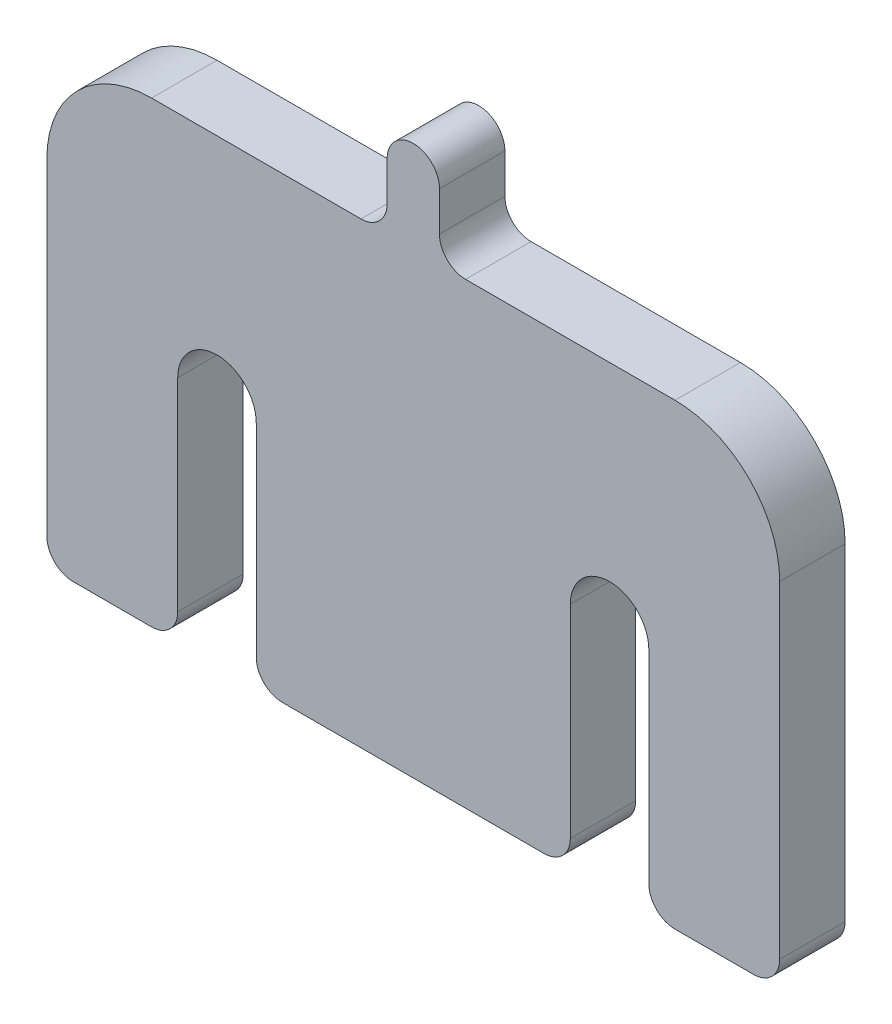
ISO-10303-21;
HEADER;
FILE_DESCRIPTION(('STEP AP214'),'2;1');
FILE_NAME('part.step','',(''),(''),'','','');
FILE_SCHEMA(('AUTOMOTIVE_DESIGN { 1 0 10303 214 1 1 1 1 }'));
ENDSEC;
DATA;
#1=APPLICATION_CONTEXT('core data for automotive mechanical design processes');
#2=APPLICATION_PROTOCOL_DEFINITION('international standard','automotive_design',2000,#1);
#3=PRODUCT_CONTEXT('',#1,'mechanical');
#4=PRODUCT('Part','Part','',(#3));
#5=PRODUCT_RELATED_PRODUCT_CATEGORY('part','',(#4));
#6=PRODUCT_DEFINITION_FORMATION('','',#4);
#7=PRODUCT_DEFINITION_CONTEXT('part definition',#1,'design');
#8=PRODUCT_DEFINITION('design','',#6,#7);
#9=PRODUCT_DEFINITION_SHAPE('','',#8);
#10=(LENGTH_UNIT() NAMED_UNIT(*) SI_UNIT(.MILLI.,.METRE.));
#11=(NAMED_UNIT(*) PLANE_ANGLE_UNIT() SI_UNIT($,.RADIAN.));
#12=(NAMED_UNIT(*) SI_UNIT($,.STERADIAN.) SOLID_ANGLE_UNIT());
#13=UNCERTAINTY_MEASURE_WITH_UNIT(LENGTH_MEASURE(1.E-05),#10,'distance_accuracy_value','');
#14=(GEOMETRIC_REPRESENTATION_CONTEXT(3) GLOBAL_UNCERTAINTY_ASSIGNED_CONTEXT((#13)) GLOBAL_UNIT_ASSIGNED_CONTEXT((#10,
#11,#12)) REPRESENTATION_CONTEXT('',''));
#15=CARTESIAN_POINT('',(0.,0.,0.));
#16=DIRECTION('',(0.,0.,1.));
#17=DIRECTION('',(1.,0.,0.));
#18=AXIS2_PLACEMENT_3D('',#15,#16,#17);
#19=CARTESIAN_POINT('',(15.,0.,-5.));
#20=DIRECTION('',(0.,0.,1.));
#21=DIRECTION('',(-1.,0.,0.));
#22=AXIS2_PLACEMENT_3D('',#19,#20,#21);
#23=CYLINDRICAL_SURFACE('',#22,3.);
#24=CARTESIAN_POINT('',(15.,0.,0.));
#25=DIRECTION('',(0.,0.,1.));
#26=DIRECTION('',(1.,0.,0.));
#27=AXIS2_PLACEMENT_3D('',#24,#25,#26);
#28=CIRCLE('',#27,3.);
#29=CARTESIAN_POINT('',(18.,0.,0.));
#30=VERTEX_POINT('',#29);
#31=CARTESIAN_POINT('',(12.,0.,0.));
#32=VERTEX_POINT('',#31);
#33=EDGE_CURVE('E277',#30,#32,#28,.T.);
#34=ORIENTED_EDGE('',*,*,#33,.T.);
#35=DIRECTION('',(0.,0.,1.));
#36=VECTOR('',#35,1.);
#37=CARTESIAN_POINT('',(12.,0.,-5.));
#38=LINE('',#37,#36);
#39=CARTESIAN_POINT('',(12.,0.,-5.));
#40=VERTEX_POINT('',#39);
#41=EDGE_CURVE('E237',#40,#32,#38,.T.);
#42=ORIENTED_EDGE('',*,*,#41,.F.);
#43=CARTESIAN_POINT('',(15.,0.,-5.));
#44=DIRECTION('',(0.,0.,1.));
#45=DIRECTION('',(1.,0.,0.));
#46=AXIS2_PLACEMENT_3D('',#43,#44,#45);
#47=CIRCLE('',#46,3.);
#48=CARTESIAN_POINT('',(18.,0.,-5.));
#49=VERTEX_POINT('',#48);
#50=EDGE_CURVE('E216',#49,#40,#47,.T.);
#51=ORIENTED_EDGE('',*,*,#50,.F.);
#52=DIRECTION('',(0.,0.,1.));
#53=VECTOR('',#52,1.);
#54=CARTESIAN_POINT('',(18.,0.,-5.));
#55=LINE('',#54,#53);
#56=EDGE_CURVE('E226',#49,#30,#55,.T.);
#57=ORIENTED_EDGE('',*,*,#56,.T.);
#58=EDGE_LOOP('',(#34,#42,#51,#57));
#59=FACE_BOUND('',#58,.T.);
#60=ADVANCED_FACE('F39',(#59),#23,.F.);
#61=CARTESIAN_POINT('',(18.,0.,-5.));
#62=DIRECTION('',(1.,0.,0.));
#63=DIRECTION('',(0.,1.,0.));
#64=AXIS2_PLACEMENT_3D('',#61,#62,#63);
#65=PLANE('',#64);
#66=DIRECTION('',(0.,-1.,0.));
#67=VECTOR('',#66,1.);
#68=CARTESIAN_POINT('',(18.,0.,0.));
#69=LINE('',#68,#67);
#70=CARTESIAN_POINT('',(18.,-15.5,0.));
#71=VERTEX_POINT('',#70);
#72=EDGE_CURVE('E229',#30,#71,#69,.T.);
#73=ORIENTED_EDGE('',*,*,#72,.F.);
#74=ORIENTED_EDGE('',*,*,#56,.F.);
#75=DIRECTION('',(0.,-1.,0.));
#76=VECTOR('',#75,1.);
#77=CARTESIAN_POINT('',(18.,0.,-5.));
#78=LINE('',#77,#76);
#79=CARTESIAN_POINT('',(18.,-15.5,-5.));
#80=VERTEX_POINT('',#79);
#81=EDGE_CURVE('E210',#49,#80,#78,.T.);
#82=ORIENTED_EDGE('',*,*,#81,.T.);
#83=DIRECTION('',(0.,0.,1.));
#84=VECTOR('',#83,1.);
#85=CARTESIAN_POINT('',(18.,-15.5,-5.));
#86=LINE('',#85,#84);
#87=EDGE_CURVE('E384',#71,#80,#86,.F.);
#88=ORIENTED_EDGE('',*,*,#87,.F.);
#89=EDGE_LOOP('',(#73,#74,#82,#88));
#90=FACE_BOUND('',#89,.T.);
#91=ADVANCED_FACE('F227',(#90),#65,.F.);
#92=CARTESIAN_POINT('',(0.,-17.5,-5.));
#93=DIRECTION('',(0.,-1.,0.));
#94=DIRECTION('',(1.,0.,0.));
#95=AXIS2_PLACEMENT_3D('',#92,#93,#94);
#96=PLANE('',#95);
#97=DIRECTION('',(-1.,0.,0.));
#98=VECTOR('',#97,1.);
#99=CARTESIAN_POINT('',(0.,-17.5,-5.));
#100=LINE('',#99,#98);
#101=CARTESIAN_POINT('',(26.,-17.5,-5.));
#102=VERTEX_POINT('',#101);
#103=CARTESIAN_POINT('',(20.,-17.5,-5.));
#104=VERTEX_POINT('',#103);
#105=EDGE_CURVE('E223',#102,#104,#100,.T.);
#106=ORIENTED_EDGE('',*,*,#105,.F.);
#107=DIRECTION('',(0.,0.,1.));
#108=VECTOR('',#107,1.);
#109=CARTESIAN_POINT('',(26.,-17.5,-5.));
#110=LINE('',#109,#108);
#111=CARTESIAN_POINT('',(26.,-17.5,0.));
#112=VERTEX_POINT('',#111);
#113=EDGE_CURVE('E378',#112,#102,#110,.F.);
#114=ORIENTED_EDGE('',*,*,#113,.F.);
#115=DIRECTION('',(-1.,0.,0.));
#116=VECTOR('',#115,1.);
#117=CARTESIAN_POINT('',(0.,-17.5,0.));
#118=LINE('',#117,#116);
#119=CARTESIAN_POINT('',(20.,-17.5,0.));
#120=VERTEX_POINT('',#119);
#121=EDGE_CURVE('E280',#112,#120,#118,.T.);
#122=ORIENTED_EDGE('',*,*,#121,.T.);
#123=DIRECTION('',(0.,0.,1.));
#124=VECTOR('',#123,1.);
#125=CARTESIAN_POINT('',(20.,-17.5,0.));
#126=LINE('',#125,#124);
#127=EDGE_CURVE('E381',#104,#120,#126,.T.);
#128=ORIENTED_EDGE('',*,*,#127,.F.);
#129=EDGE_LOOP('',(#106,#114,#122,#128));
#130=FACE_BOUND('',#129,.T.);
#131=ADVANCED_FACE('F432',(#130),#96,.T.);
#132=CARTESIAN_POINT('',(28.,0.,-5.));
#133=DIRECTION('',(-1.,0.,0.));
#134=DIRECTION('',(0.,0.,-1.));
#135=AXIS2_PLACEMENT_3D('',#132,#133,#134);
#136=PLANE('',#135);
#137=DIRECTION('',(0.,1.,0.));
#138=VECTOR('',#137,1.);
#139=CARTESIAN_POINT('',(28.,0.,0.));
#140=LINE('',#139,#138);
#141=CARTESIAN_POINT('',(28.,-15.5,0.));
#142=VERTEX_POINT('',#141);
#143=CARTESIAN_POINT('',(28.,9.5,0.));
#144=VERTEX_POINT('',#143);
#145=EDGE_CURVE('E283',#142,#144,#140,.T.);
#146=ORIENTED_EDGE('',*,*,#145,.F.);
#147=DIRECTION('',(0.,0.,1.));
#148=VECTOR('',#147,1.);
#149=CARTESIAN_POINT('',(28.,-15.5,0.));
#150=LINE('',#149,#148);
#151=CARTESIAN_POINT('',(28.,-15.5,-5.));
#152=VERTEX_POINT('',#151);
#153=EDGE_CURVE('E389',#152,#142,#150,.T.);
#154=ORIENTED_EDGE('',*,*,#153,.F.);
#155=DIRECTION('',(0.,1.,0.));
#156=VECTOR('',#155,1.);
#157=CARTESIAN_POINT('',(28.,0.,-5.));
#158=LINE('',#157,#156);
#159=CARTESIAN_POINT('',(28.,9.5,-5.));
#160=VERTEX_POINT('',#159);
#161=EDGE_CURVE('E250',#152,#160,#158,.T.);
#162=ORIENTED_EDGE('',*,*,#161,.T.);
#163=DIRECTION('',(0.,0.,1.));
#164=VECTOR('',#163,1.);
#165=CARTESIAN_POINT('',(28.,9.5,-5.));
#166=LINE('',#165,#164);
#167=EDGE_CURVE('E11',#144,#160,#166,.F.);
#168=ORIENTED_EDGE('',*,*,#167,.F.);
#169=EDGE_LOOP('',(#146,#154,#162,#168));
#170=FACE_BOUND('',#169,.T.);
#171=ADVANCED_FACE('F425',(#170),#136,.F.);
#172=CARTESIAN_POINT('',(0.,17.5,-5.));
#173=DIRECTION('',(0.,-1.,0.));
#174=DIRECTION('',(1.,0.,0.));
#175=AXIS2_PLACEMENT_3D('',#172,#173,#174);
#176=PLANE('',#175);
#177=DIRECTION('',(-1.,0.,0.));
#178=VECTOR('',#177,1.);
#179=CARTESIAN_POINT('',(0.,17.5,-5.));
#180=LINE('',#179,#178);
#181=CARTESIAN_POINT('',(20.,17.5,-5.));
#182=VERTEX_POINT('',#181);
#183=CARTESIAN_POINT('',(4.,17.5,-5.));
#184=VERTEX_POINT('',#183);
#185=EDGE_CURVE('E253',#182,#184,#180,.T.);
#186=ORIENTED_EDGE('',*,*,#185,.T.);
#187=DIRECTION('',(0.,0.,1.));
#188=VECTOR('',#187,1.);
#189=CARTESIAN_POINT('',(4.,17.5,-5.));
#190=LINE('',#189,#188);
#191=CARTESIAN_POINT('',(4.,17.5,0.));
#192=VERTEX_POINT('',#191);
#193=EDGE_CURVE('E331',#192,#184,#190,.F.);
#194=ORIENTED_EDGE('',*,*,#193,.F.);
#195=DIRECTION('',(-1.,0.,0.));
#196=VECTOR('',#195,1.);
#197=CARTESIAN_POINT('',(0.,17.5,0.));
#198=LINE('',#197,#196);
#199=CARTESIAN_POINT('',(20.,17.5,0.));
#200=VERTEX_POINT('',#199);
#201=EDGE_CURVE('E287',#200,#192,#198,.T.);
#202=ORIENTED_EDGE('',*,*,#201,.F.);
#203=DIRECTION('',(0.,0.,1.));
#204=VECTOR('',#203,1.);
#205=CARTESIAN_POINT('',(20.,17.5,-5.));
#206=LINE('',#205,#204);
#207=EDGE_CURVE('E47',#182,#200,#206,.T.);
#208=ORIENTED_EDGE('',*,*,#207,.F.);
#209=EDGE_LOOP('',(#186,#194,#202,#208));
#210=FACE_BOUND('',#209,.T.);
#211=ADVANCED_FACE('F416',(#210),#176,.F.);
#212=CARTESIAN_POINT('',(2.,0.,-5.));
#213=DIRECTION('',(1.,0.,0.));
#214=DIRECTION('',(0.,1.,0.));
#215=AXIS2_PLACEMENT_3D('',#212,#213,#214);
#216=PLANE('',#215);
#217=DIRECTION('',(0.,-1.,0.));
#218=VECTOR('',#217,1.);
#219=CARTESIAN_POINT('',(2.,0.,-5.));
#220=LINE('',#219,#218);
#221=CARTESIAN_POINT('',(2.,22.5,-5.));
#222=VERTEX_POINT('',#221);
#223=CARTESIAN_POINT('',(2.,19.5,-5.));
#224=VERTEX_POINT('',#223);
#225=EDGE_CURVE('E256',#222,#224,#220,.T.);
#226=ORIENTED_EDGE('',*,*,#225,.F.);
#227=DIRECTION('',(0.,0.,1.));
#228=VECTOR('',#227,1.);
#229=CARTESIAN_POINT('',(2.,22.5,-5.));
#230=LINE('',#229,#228);
#231=CARTESIAN_POINT('',(2.,22.5,0.));
#232=VERTEX_POINT('',#231);
#233=EDGE_CURVE('E234',#222,#232,#230,.T.);
#234=ORIENTED_EDGE('',*,*,#233,.T.);
#235=DIRECTION('',(0.,-1.,0.));
#236=VECTOR('',#235,1.);
#237=CARTESIAN_POINT('',(2.,0.,0.));
#238=LINE('',#237,#236);
#239=CARTESIAN_POINT('',(2.,19.5,0.));
#240=VERTEX_POINT('',#239);
#241=EDGE_CURVE('E290',#232,#240,#238,.T.);
#242=ORIENTED_EDGE('',*,*,#241,.T.);
#243=DIRECTION('',(0.,0.,1.));
#244=VECTOR('',#243,1.);
#245=CARTESIAN_POINT('',(2.,19.5,-5.));
#246=LINE('',#245,#244);
#247=EDGE_CURVE('E328',#224,#240,#246,.T.);
#248=ORIENTED_EDGE('',*,*,#247,.F.);
#249=EDGE_LOOP('',(#226,#234,#242,#248));
#250=FACE_BOUND('',#249,.T.);
#251=ADVANCED_FACE('F469',(#250),#216,.T.);
#252=CARTESIAN_POINT('',(0.,22.5,-5.));
#253=DIRECTION('',(0.,0.,1.));
#254=DIRECTION('',(-1.,0.,0.));
#255=AXIS2_PLACEMENT_3D('',#252,#253,#254);
#256=CYLINDRICAL_SURFACE('',#255,2.);
#257=CARTESIAN_POINT('',(0.,22.5,0.));
#258=DIRECTION('',(0.,0.,1.));
#259=DIRECTION('',(1.,0.,0.));
#260=AXIS2_PLACEMENT_3D('',#257,#258,#259);
#261=CIRCLE('',#260,2.);
#262=CARTESIAN_POINT('',(-2.,22.5,0.));
#263=VERTEX_POINT('',#262);
#264=EDGE_CURVE('E294',#232,#263,#261,.T.);
#265=ORIENTED_EDGE('',*,*,#264,.F.);
#266=ORIENTED_EDGE('',*,*,#233,.F.);
#267=CARTESIAN_POINT('',(0.,22.5,-5.));
#268=DIRECTION('',(0.,0.,1.));
#269=DIRECTION('',(1.,0.,0.));
#270=AXIS2_PLACEMENT_3D('',#267,#268,#269);
#271=CIRCLE('',#270,2.);
#272=CARTESIAN_POINT('',(-2.,22.5,-5.));
#273=VERTEX_POINT('',#272);
#274=EDGE_CURVE('E260',#222,#273,#271,.T.);
#275=ORIENTED_EDGE('',*,*,#274,.T.);
#276=DIRECTION('',(0.,0.,1.));
#277=VECTOR('',#276,1.);
#278=CARTESIAN_POINT('',(-2.,22.5,-5.));
#279=LINE('',#278,#277);
#280=EDGE_CURVE('E318',#273,#263,#279,.T.);
#281=ORIENTED_EDGE('',*,*,#280,.T.);
#282=EDGE_LOOP('',(#265,#266,#275,#281));
#283=FACE_BOUND('',#282,.T.);
#284=ADVANCED_FACE('F465',(#283),#256,.T.);
#285=CARTESIAN_POINT('',(-2.,0.,-5.));
#286=DIRECTION('',(1.,0.,0.));
#287=DIRECTION('',(0.,1.,0.));
#288=AXIS2_PLACEMENT_3D('',#285,#286,#287);
#289=PLANE('',#288);
#290=DIRECTION('',(0.,-1.,0.));
#291=VECTOR('',#290,1.);
#292=CARTESIAN_POINT('',(-2.,0.,0.));
#293=LINE('',#292,#291);
#294=CARTESIAN_POINT('',(-2.,19.5,0.));
#295=VERTEX_POINT('',#294);
#296=EDGE_CURVE('E297',#263,#295,#293,.T.);
#297=ORIENTED_EDGE('',*,*,#296,.F.);
#298=ORIENTED_EDGE('',*,*,#280,.F.);
#299=DIRECTION('',(0.,-1.,0.));
#300=VECTOR('',#299,1.);
#301=CARTESIAN_POINT('',(-2.,0.,-5.));
#302=LINE('',#301,#300);
#303=CARTESIAN_POINT('',(-2.,19.5,-5.));
#304=VERTEX_POINT('',#303);
#305=EDGE_CURVE('E263',#273,#304,#302,.T.);
#306=ORIENTED_EDGE('',*,*,#305,.T.);
#307=DIRECTION('',(0.,0.,1.));
#308=VECTOR('',#307,1.);
#309=CARTESIAN_POINT('',(-2.,19.5,-5.));
#310=LINE('',#309,#308);
#311=EDGE_CURVE('E325',#295,#304,#310,.F.);
#312=ORIENTED_EDGE('',*,*,#311,.F.);
#313=EDGE_LOOP('',(#297,#298,#306,#312));
#314=FACE_BOUND('',#313,.T.);
#315=ADVANCED_FACE('F463',(#314),#289,.F.);
#316=CARTESIAN_POINT('',(-4.,17.5,0.));
#317=VERTEX_POINT('',#316);
#318=CARTESIAN_POINT('',(-20.,17.5,0.));
#319=VERTEX_POINT('',#318);
#320=EDGE_CURVE('E291',#317,#319,#198,.T.);
#321=ORIENTED_EDGE('',*,*,#320,.F.);
#322=DIRECTION('',(0.,0.,1.));
#323=VECTOR('',#322,1.);
#324=CARTESIAN_POINT('',(-4.,17.5,0.));
#325=LINE('',#324,#323);
#326=CARTESIAN_POINT('',(-4.,17.5,-5.));
#327=VERTEX_POINT('',#326);
#328=EDGE_CURVE('E233',#327,#317,#325,.T.);
#329=ORIENTED_EDGE('',*,*,#328,.F.);
#330=CARTESIAN_POINT('',(-20.,17.5,-5.));
#331=VERTEX_POINT('',#330);
#332=EDGE_CURVE('E257',#327,#331,#180,.T.);
#333=ORIENTED_EDGE('',*,*,#332,.T.);
#334=DIRECTION('',(0.,0.,1.));
#335=VECTOR('',#334,1.);
#336=CARTESIAN_POINT('',(-20.,17.5,-5.));
#337=LINE('',#336,#335);
#338=EDGE_CURVE('E407',#319,#331,#337,.F.);
#339=ORIENTED_EDGE('',*,*,#338,.F.);
#340=EDGE_LOOP('',(#321,#329,#333,#339));
#341=FACE_BOUND('',#340,.T.);
#342=ADVANCED_FACE('F456',(#341),#176,.F.);
#343=CARTESIAN_POINT('',(-28.,0.,-5.));
#344=DIRECTION('',(-1.,0.,0.));
#345=DIRECTION('',(0.,0.,-1.));
#346=AXIS2_PLACEMENT_3D('',#343,#344,#345);
#347=PLANE('',#346);
#348=DIRECTION('',(0.,1.,0.));
#349=VECTOR('',#348,1.);
#350=CARTESIAN_POINT('',(-28.,0.,-5.));
#351=LINE('',#350,#349);
#352=CARTESIAN_POINT('',(-28.,-15.5,-5.));
#353=VERTEX_POINT('',#352);
#354=CARTESIAN_POINT('',(-28.,9.5,-5.));
#355=VERTEX_POINT('',#354);
#356=EDGE_CURVE('E266',#353,#355,#351,.T.);
#357=ORIENTED_EDGE('',*,*,#356,.F.);
#358=DIRECTION('',(0.,0.,1.));
#359=VECTOR('',#358,1.);
#360=CARTESIAN_POINT('',(-28.,-15.5,-5.));
#361=LINE('',#360,#359);
#362=CARTESIAN_POINT('',(-28.,-15.5,0.));
#363=VERTEX_POINT('',#362);
#364=EDGE_CURVE('E386',#363,#353,#361,.F.);
#365=ORIENTED_EDGE('',*,*,#364,.F.);
#366=DIRECTION('',(0.,1.,0.));
#367=VECTOR('',#366,1.);
#368=CARTESIAN_POINT('',(-28.,0.,0.));
#369=LINE('',#368,#367);
#370=CARTESIAN_POINT('',(-28.,9.5,0.));
#371=VERTEX_POINT('',#370);
#372=EDGE_CURVE('E300',#363,#371,#369,.T.);
#373=ORIENTED_EDGE('',*,*,#372,.T.);
#374=DIRECTION('',(0.,0.,1.));
#375=VECTOR('',#374,1.);
#376=CARTESIAN_POINT('',(-28.,9.5,0.));
#377=LINE('',#376,#375);
#378=EDGE_CURVE('E400',#355,#371,#377,.T.);
#379=ORIENTED_EDGE('',*,*,#378,.F.);
#380=EDGE_LOOP('',(#357,#365,#373,#379));
#381=FACE_BOUND('',#380,.T.);
#382=ADVANCED_FACE('F447',(#381),#347,.T.);
#383=CARTESIAN_POINT('',(-20.,-17.5,0.));
#384=VERTEX_POINT('',#383);
#385=CARTESIAN_POINT('',(-26.,-17.5,0.));
#386=VERTEX_POINT('',#385);
#387=EDGE_CURVE('E284',#384,#386,#118,.T.);
#388=ORIENTED_EDGE('',*,*,#387,.T.);
#389=DIRECTION('',(0.,0.,1.));
#390=VECTOR('',#389,1.);
#391=CARTESIAN_POINT('',(-26.,-17.5,-5.));
#392=LINE('',#391,#390);
#393=CARTESIAN_POINT('',(-26.,-17.5,-5.));
#394=VERTEX_POINT('',#393);
#395=EDGE_CURVE('E349',#394,#386,#392,.T.);
#396=ORIENTED_EDGE('',*,*,#395,.F.);
#397=CARTESIAN_POINT('',(-20.,-17.5,-5.));
#398=VERTEX_POINT('',#397);
#399=EDGE_CURVE('E249',#398,#394,#100,.T.);
#400=ORIENTED_EDGE('',*,*,#399,.F.);
#401=DIRECTION('',(0.,0.,1.));
#402=VECTOR('',#401,1.);
#403=CARTESIAN_POINT('',(-20.,-17.5,-5.));
#404=LINE('',#403,#402);
#405=EDGE_CURVE('E352',#384,#398,#404,.F.);
#406=ORIENTED_EDGE('',*,*,#405,.F.);
#407=EDGE_LOOP('',(#388,#396,#400,#406));
#408=FACE_BOUND('',#407,.T.);
#409=ADVANCED_FACE('F439',(#408),#96,.T.);
#410=CARTESIAN_POINT('',(-18.,0.,-5.));
#411=DIRECTION('',(1.,0.,0.));
#412=DIRECTION('',(0.,1.,0.));
#413=AXIS2_PLACEMENT_3D('',#410,#411,#412);
#414=PLANE('',#413);
#415=DIRECTION('',(0.,-1.,0.));
#416=VECTOR('',#415,1.);
#417=CARTESIAN_POINT('',(-18.,0.,-5.));
#418=LINE('',#417,#416);
#419=CARTESIAN_POINT('',(-18.,0.,-5.));
#420=VERTEX_POINT('',#419);
#421=CARTESIAN_POINT('',(-18.,-15.5,-5.));
#422=VERTEX_POINT('',#421);
#423=EDGE_CURVE('E269',#420,#422,#418,.T.);
#424=ORIENTED_EDGE('',*,*,#423,.F.);
#425=DIRECTION('',(0.,0.,1.));
#426=VECTOR('',#425,1.);
#427=CARTESIAN_POINT('',(-18.,0.,-5.));
#428=LINE('',#427,#426);
#429=CARTESIAN_POINT('',(-18.,0.,0.));
#430=VERTEX_POINT('',#429);
#431=EDGE_CURVE('E315',#420,#430,#428,.T.);
#432=ORIENTED_EDGE('',*,*,#431,.T.);
#433=DIRECTION('',(0.,-1.,0.));
#434=VECTOR('',#433,1.);
#435=CARTESIAN_POINT('',(-18.,0.,0.));
#436=LINE('',#435,#434);
#437=CARTESIAN_POINT('',(-18.,-15.5,0.));
#438=VERTEX_POINT('',#437);
#439=EDGE_CURVE('E303',#430,#438,#436,.T.);
#440=ORIENTED_EDGE('',*,*,#439,.T.);
#441=DIRECTION('',(0.,0.,1.));
#442=VECTOR('',#441,1.);
#443=CARTESIAN_POINT('',(-18.,-15.5,-5.));
#444=LINE('',#443,#442);
#445=EDGE_CURVE('E334',#422,#438,#444,.T.);
#446=ORIENTED_EDGE('',*,*,#445,.F.);
#447=EDGE_LOOP('',(#424,#432,#440,#446));
#448=FACE_BOUND('',#447,.T.);
#449=ADVANCED_FACE('F628',(#448),#414,.T.);
#450=CARTESIAN_POINT('',(-15.,0.,-5.));
#451=DIRECTION('',(0.,0.,1.));
#452=DIRECTION('',(-1.,0.,0.));
#453=AXIS2_PLACEMENT_3D('',#450,#451,#452);
#454=CYLINDRICAL_SURFACE('',#453,3.);
#455=CARTESIAN_POINT('',(-15.,0.,0.));
#456=DIRECTION('',(0.,0.,1.));
#457=DIRECTION('',(1.,0.,0.));
#458=AXIS2_PLACEMENT_3D('',#455,#456,#457);
#459=CIRCLE('',#458,3.);
#460=CARTESIAN_POINT('',(-12.,0.,0.));
#461=VERTEX_POINT('',#460);
#462=EDGE_CURVE('E306',#461,#430,#459,.T.);
#463=ORIENTED_EDGE('',*,*,#462,.T.);
#464=ORIENTED_EDGE('',*,*,#431,.F.);
#465=CARTESIAN_POINT('',(-15.,0.,-5.));
#466=DIRECTION('',(0.,0.,1.));
#467=DIRECTION('',(1.,0.,0.));
#468=AXIS2_PLACEMENT_3D('',#465,#466,#467);
#469=CIRCLE('',#468,3.);
#470=CARTESIAN_POINT('',(-12.,0.,-5.));
#471=VERTEX_POINT('',#470);
#472=EDGE_CURVE('E272',#471,#420,#469,.T.);
#473=ORIENTED_EDGE('',*,*,#472,.F.);
#474=DIRECTION('',(0.,0.,1.));
#475=VECTOR('',#474,1.);
#476=CARTESIAN_POINT('',(-12.,0.,-5.));
#477=LINE('',#476,#475);
#478=EDGE_CURVE('E312',#471,#461,#477,.T.);
#479=ORIENTED_EDGE('',*,*,#478,.T.);
#480=EDGE_LOOP('',(#463,#464,#473,#479));
#481=FACE_BOUND('',#480,.T.);
#482=ADVANCED_FACE('F619',(#481),#454,.F.);
#483=CARTESIAN_POINT('',(-12.,0.,-5.));
#484=DIRECTION('',(1.,0.,0.));
#485=DIRECTION('',(0.,1.,0.));
#486=AXIS2_PLACEMENT_3D('',#483,#484,#485);
#487=PLANE('',#486);
#488=DIRECTION('',(0.,-1.,0.));
#489=VECTOR('',#488,1.);
#490=CARTESIAN_POINT('',(-12.,0.,0.));
#491=LINE('',#490,#489);
#492=CARTESIAN_POINT('',(-12.,-15.5,0.));
#493=VERTEX_POINT('',#492);
#494=EDGE_CURVE('E308',#461,#493,#491,.T.);
#495=ORIENTED_EDGE('',*,*,#494,.F.);
#496=ORIENTED_EDGE('',*,*,#478,.F.);
#497=DIRECTION('',(0.,-1.,0.));
#498=VECTOR('',#497,1.);
#499=CARTESIAN_POINT('',(-12.,0.,-5.));
#500=LINE('',#499,#498);
#501=CARTESIAN_POINT('',(-12.,-15.5,-5.));
#502=VERTEX_POINT('',#501);
#503=EDGE_CURVE('E248',#471,#502,#500,.T.);
#504=ORIENTED_EDGE('',*,*,#503,.T.);
#505=DIRECTION('',(0.,0.,1.));
#506=VECTOR('',#505,1.);
#507=CARTESIAN_POINT('',(-12.,-15.5,-5.));
#508=LINE('',#507,#506);
#509=EDGE_CURVE('E372',#493,#502,#508,.F.);
#510=ORIENTED_EDGE('',*,*,#509,.F.);
#511=EDGE_LOOP('',(#495,#496,#504,#510));
#512=FACE_BOUND('',#511,.T.);
#513=ADVANCED_FACE('F611',(#512),#487,.F.);
#514=CARTESIAN_POINT('',(10.,-17.5,-5.));
#515=VERTEX_POINT('',#514);
#516=CARTESIAN_POINT('',(-10.,-17.5,-5.));
#517=VERTEX_POINT('',#516);
#518=EDGE_CURVE('E244',#515,#517,#100,.T.);
#519=ORIENTED_EDGE('',*,*,#518,.F.);
#520=DIRECTION('',(0.,0.,1.));
#521=VECTOR('',#520,1.);
#522=CARTESIAN_POINT('',(10.,-17.5,-5.));
#523=LINE('',#522,#521);
#524=CARTESIAN_POINT('',(10.,-17.5,0.));
#525=VERTEX_POINT('',#524);
#526=EDGE_CURVE('E366',#525,#515,#523,.F.);
#527=ORIENTED_EDGE('',*,*,#526,.F.);
#528=CARTESIAN_POINT('',(-10.,-17.5,0.));
#529=VERTEX_POINT('',#528);
#530=EDGE_CURVE('E241',#525,#529,#118,.T.);
#531=ORIENTED_EDGE('',*,*,#530,.T.);
#532=DIRECTION('',(0.,0.,1.));
#533=VECTOR('',#532,1.);
#534=CARTESIAN_POINT('',(-10.,-17.5,0.));
#535=LINE('',#534,#533);
#536=EDGE_CURVE('E369',#517,#529,#535,.T.);
#537=ORIENTED_EDGE('',*,*,#536,.F.);
#538=EDGE_LOOP('',(#519,#527,#531,#537));
#539=FACE_BOUND('',#538,.T.);
#540=ADVANCED_FACE('F479',(#539),#96,.T.);
#541=CARTESIAN_POINT('',(12.,0.,-5.));
#542=DIRECTION('',(1.,0.,0.));
#543=DIRECTION('',(0.,1.,0.));
#544=AXIS2_PLACEMENT_3D('',#541,#542,#543);
#545=PLANE('',#544);
#546=DIRECTION('',(0.,-1.,0.));
#547=VECTOR('',#546,1.);
#548=CARTESIAN_POINT('',(12.,0.,-5.));
#549=LINE('',#548,#547);
#550=CARTESIAN_POINT('',(12.,-15.5,-5.));
#551=VERTEX_POINT('',#550);
#552=EDGE_CURVE('E247',#40,#551,#549,.T.);
#553=ORIENTED_EDGE('',*,*,#552,.F.);
#554=ORIENTED_EDGE('',*,*,#41,.T.);
#555=DIRECTION('',(0.,-1.,0.));
#556=VECTOR('',#555,1.);
#557=CARTESIAN_POINT('',(12.,0.,0.));
#558=LINE('',#557,#556);
#559=CARTESIAN_POINT('',(12.,-15.5,0.));
#560=VERTEX_POINT('',#559);
#561=EDGE_CURVE('E238',#32,#560,#558,.T.);
#562=ORIENTED_EDGE('',*,*,#561,.T.);
#563=DIRECTION('',(0.,0.,1.));
#564=VECTOR('',#563,1.);
#565=CARTESIAN_POINT('',(12.,-15.5,-5.));
#566=LINE('',#565,#564);
#567=EDGE_CURVE('E375',#551,#560,#566,.T.);
#568=ORIENTED_EDGE('',*,*,#567,.F.);
#569=EDGE_LOOP('',(#553,#554,#562,#568));
#570=FACE_BOUND('',#569,.T.);
#571=ADVANCED_FACE('F489',(#570),#545,.T.);
#572=CARTESIAN_POINT('',(0.,0.,-5.));
#573=DIRECTION('',(0.,0.,-1.));
#574=DIRECTION('',(1.,0.,0.));
#575=AXIS2_PLACEMENT_3D('',#572,#573,#574);
#576=PLANE('',#575);
#577=ORIENTED_EDGE('',*,*,#332,.F.);
#578=CARTESIAN_POINT('',(-4.,19.5,-5.));
#579=DIRECTION('',(0.,0.,1.));
#580=DIRECTION('',(1.,0.,0.));
#581=AXIS2_PLACEMENT_3D('',#578,#579,#580);
#582=CIRCLE('',#581,2.);
#583=EDGE_CURVE('E394',#304,#327,#582,.F.);
#584=ORIENTED_EDGE('',*,*,#583,.F.);
#585=ORIENTED_EDGE('',*,*,#305,.F.);
#586=ORIENTED_EDGE('',*,*,#274,.F.);
#587=ORIENTED_EDGE('',*,*,#225,.T.);
#588=CARTESIAN_POINT('',(4.,19.5,-5.));
#589=DIRECTION('',(0.,0.,1.));
#590=DIRECTION('',(1.,0.,0.));
#591=AXIS2_PLACEMENT_3D('',#588,#589,#590);
#592=CIRCLE('',#591,2.);
#593=EDGE_CURVE('E398',#184,#224,#592,.F.);
#594=ORIENTED_EDGE('',*,*,#593,.F.);
#595=ORIENTED_EDGE('',*,*,#185,.F.);
#596=CARTESIAN_POINT('',(20.,9.5,-5.));
#597=DIRECTION('',(0.,0.,1.));
#598=DIRECTION('',(1.,0.,0.));
#599=AXIS2_PLACEMENT_3D('',#596,#597,#598);
#600=CIRCLE('',#599,8.);
#601=EDGE_CURVE('E53',#160,#182,#600,.T.);
#602=ORIENTED_EDGE('',*,*,#601,.F.);
#603=ORIENTED_EDGE('',*,*,#161,.F.);
#604=CARTESIAN_POINT('',(26.,-15.5,-5.));
#605=DIRECTION('',(0.,0.,1.));
#606=DIRECTION('',(1.,0.,0.));
#607=AXIS2_PLACEMENT_3D('',#604,#605,#606);
#608=CIRCLE('',#607,2.);
#609=EDGE_CURVE('E355',#102,#152,#608,.T.);
#610=ORIENTED_EDGE('',*,*,#609,.F.);
#611=ORIENTED_EDGE('',*,*,#105,.T.);
#612=CARTESIAN_POINT('',(20.,-15.5,-5.));
#613=DIRECTION('',(0.,0.,1.));
#614=DIRECTION('',(1.,0.,0.));
#615=AXIS2_PLACEMENT_3D('',#612,#613,#614);
#616=CIRCLE('',#615,2.);
#617=EDGE_CURVE('E219',#80,#104,#616,.T.);
#618=ORIENTED_EDGE('',*,*,#617,.F.);
#619=ORIENTED_EDGE('',*,*,#81,.F.);
#620=ORIENTED_EDGE('',*,*,#50,.T.);
#621=ORIENTED_EDGE('',*,*,#552,.T.);
#622=CARTESIAN_POINT('',(10.,-15.5,-5.));
#623=DIRECTION('',(0.,0.,1.));
#624=DIRECTION('',(1.,0.,0.));
#625=AXIS2_PLACEMENT_3D('',#622,#623,#624);
#626=CIRCLE('',#625,2.);
#627=EDGE_CURVE('E360',#515,#551,#626,.T.);
#628=ORIENTED_EDGE('',*,*,#627,.F.);
#629=ORIENTED_EDGE('',*,*,#518,.T.);
#630=CARTESIAN_POINT('',(-10.,-15.5,-5.));
#631=DIRECTION('',(0.,0.,1.));
#632=DIRECTION('',(1.,0.,0.));
#633=AXIS2_PLACEMENT_3D('',#630,#631,#632);
#634=CIRCLE('',#633,2.);
#635=EDGE_CURVE('E362',#502,#517,#634,.T.);
#636=ORIENTED_EDGE('',*,*,#635,.F.);
#637=ORIENTED_EDGE('',*,*,#503,.F.);
#638=ORIENTED_EDGE('',*,*,#472,.T.);
#639=ORIENTED_EDGE('',*,*,#423,.T.);
#640=CARTESIAN_POINT('',(-20.,-15.5,-5.));
#641=DIRECTION('',(0.,0.,1.));
#642=DIRECTION('',(1.,0.,0.));
#643=AXIS2_PLACEMENT_3D('',#640,#641,#642);
#644=CIRCLE('',#643,2.);
#645=EDGE_CURVE('E364',#398,#422,#644,.T.);
#646=ORIENTED_EDGE('',*,*,#645,.F.);
#647=ORIENTED_EDGE('',*,*,#399,.T.);
#648=CARTESIAN_POINT('',(-26.,-15.5,-5.));
#649=DIRECTION('',(0.,0.,1.));
#650=DIRECTION('',(1.,0.,0.));
#651=AXIS2_PLACEMENT_3D('',#648,#649,#650);
#652=CIRCLE('',#651,2.);
#653=EDGE_CURVE('E357',#353,#394,#652,.T.);
#654=ORIENTED_EDGE('',*,*,#653,.F.);
#655=ORIENTED_EDGE('',*,*,#356,.T.);
#656=CARTESIAN_POINT('',(-20.,9.5,-5.));
#657=DIRECTION('',(0.,0.,1.));
#658=DIRECTION('',(1.,0.,0.));
#659=AXIS2_PLACEMENT_3D('',#656,#657,#658);
#660=CIRCLE('',#659,8.);
#661=EDGE_CURVE('E411',#331,#355,#660,.T.);
#662=ORIENTED_EDGE('',*,*,#661,.F.);
#663=EDGE_LOOP('',(#577,#584,#585,#586,#587,#594,#595,#602,#603,#610,#611,#618,#619,#620,#621,
#628,#629,#636,#637,#638,#639,#646,#647,#654,#655,#662));
#664=FACE_BOUND('',#663,.T.);
#665=ADVANCED_FACE('F213',(#664),#576,.T.);
#666=CARTESIAN_POINT('',(0.,0.,0.));
#667=DIRECTION('',(0.,0.,-1.));
#668=DIRECTION('',(1.,0.,0.));
#669=AXIS2_PLACEMENT_3D('',#666,#667,#668);
#670=PLANE('',#669);
#671=ORIENTED_EDGE('',*,*,#372,.F.);
#672=CARTESIAN_POINT('',(-26.,-15.5,0.));
#673=DIRECTION('',(0.,0.,1.));
#674=DIRECTION('',(1.,0.,0.));
#675=AXIS2_PLACEMENT_3D('',#672,#673,#674);
#676=CIRCLE('',#675,2.);
#677=EDGE_CURVE('E339',#386,#363,#676,.F.);
#678=ORIENTED_EDGE('',*,*,#677,.F.);
#679=ORIENTED_EDGE('',*,*,#387,.F.);
#680=CARTESIAN_POINT('',(-20.,-15.5,0.));
#681=DIRECTION('',(0.,0.,1.));
#682=DIRECTION('',(1.,0.,0.));
#683=AXIS2_PLACEMENT_3D('',#680,#681,#682);
#684=CIRCLE('',#683,2.);
#685=EDGE_CURVE('E347',#438,#384,#684,.F.);
#686=ORIENTED_EDGE('',*,*,#685,.F.);
#687=ORIENTED_EDGE('',*,*,#439,.F.);
#688=ORIENTED_EDGE('',*,*,#462,.F.);
#689=ORIENTED_EDGE('',*,*,#494,.T.);
#690=CARTESIAN_POINT('',(-10.,-15.5,0.));
#691=DIRECTION('',(0.,0.,1.));
#692=DIRECTION('',(1.,0.,0.));
#693=AXIS2_PLACEMENT_3D('',#690,#691,#692);
#694=CIRCLE('',#693,2.);
#695=EDGE_CURVE('E345',#529,#493,#694,.F.);
#696=ORIENTED_EDGE('',*,*,#695,.F.);
#697=ORIENTED_EDGE('',*,*,#530,.F.);
#698=CARTESIAN_POINT('',(10.,-15.5,0.));
#699=DIRECTION('',(0.,0.,1.));
#700=DIRECTION('',(1.,0.,0.));
#701=AXIS2_PLACEMENT_3D('',#698,#699,#700);
#702=CIRCLE('',#701,2.);
#703=EDGE_CURVE('E343',#560,#525,#702,.F.);
#704=ORIENTED_EDGE('',*,*,#703,.F.);
#705=ORIENTED_EDGE('',*,*,#561,.F.);
#706=ORIENTED_EDGE('',*,*,#33,.F.);
#707=ORIENTED_EDGE('',*,*,#72,.T.);
#708=CARTESIAN_POINT('',(20.,-15.5,0.));
#709=DIRECTION('',(0.,0.,1.));
#710=DIRECTION('',(1.,0.,0.));
#711=AXIS2_PLACEMENT_3D('',#708,#709,#710);
#712=CIRCLE('',#711,2.);
#713=EDGE_CURVE('E341',#120,#71,#712,.F.);
#714=ORIENTED_EDGE('',*,*,#713,.F.);
#715=ORIENTED_EDGE('',*,*,#121,.F.);
#716=CARTESIAN_POINT('',(26.,-15.5,0.));
#717=DIRECTION('',(0.,0.,1.));
#718=DIRECTION('',(1.,0.,0.));
#719=AXIS2_PLACEMENT_3D('',#716,#717,#718);
#720=CIRCLE('',#719,2.);
#721=EDGE_CURVE('E337',#142,#112,#720,.F.);
#722=ORIENTED_EDGE('',*,*,#721,.F.);
#723=ORIENTED_EDGE('',*,*,#145,.T.);
#724=CARTESIAN_POINT('',(20.,9.5,0.));
#725=DIRECTION('',(0.,0.,1.));
#726=DIRECTION('',(1.,0.,0.));
#727=AXIS2_PLACEMENT_3D('',#724,#725,#726);
#728=CIRCLE('',#727,8.);
#729=EDGE_CURVE('E403',#200,#144,#728,.F.);
#730=ORIENTED_EDGE('',*,*,#729,.F.);
#731=ORIENTED_EDGE('',*,*,#201,.T.);
#732=CARTESIAN_POINT('',(4.,19.5,0.));
#733=DIRECTION('',(0.,0.,1.));
#734=DIRECTION('',(1.,0.,0.));
#735=AXIS2_PLACEMENT_3D('',#732,#733,#734);
#736=CIRCLE('',#735,2.);
#737=EDGE_CURVE('E396',#240,#192,#736,.T.);
#738=ORIENTED_EDGE('',*,*,#737,.F.);
#739=ORIENTED_EDGE('',*,*,#241,.F.);
#740=ORIENTED_EDGE('',*,*,#264,.T.);
#741=ORIENTED_EDGE('',*,*,#296,.T.);
#742=CARTESIAN_POINT('',(-4.,19.5,0.));
#743=DIRECTION('',(0.,0.,1.));
#744=DIRECTION('',(1.,0.,0.));
#745=AXIS2_PLACEMENT_3D('',#742,#743,#744);
#746=CIRCLE('',#745,2.);
#747=EDGE_CURVE('E392',#317,#295,#746,.T.);
#748=ORIENTED_EDGE('',*,*,#747,.F.);
#749=ORIENTED_EDGE('',*,*,#320,.T.);
#750=CARTESIAN_POINT('',(-20.,9.5,0.));
#751=DIRECTION('',(0.,0.,1.));
#752=DIRECTION('',(1.,0.,0.));
#753=AXIS2_PLACEMENT_3D('',#750,#751,#752);
#754=CIRCLE('',#753,8.);
#755=EDGE_CURVE('E405',#371,#319,#754,.F.);
#756=ORIENTED_EDGE('',*,*,#755,.F.);
#757=EDGE_LOOP('',(#671,#678,#679,#686,#687,#688,#689,#696,#697,#704,#705,#706,#707,#714,#715,
#722,#723,#730,#731,#738,#739,#740,#741,#748,#749,#756));
#758=FACE_BOUND('',#757,.T.);
#759=ADVANCED_FACE('F419',(#758),#670,.F.);
#760=CARTESIAN_POINT('',(-4.,19.5,-5.));
#761=DIRECTION('',(0.,0.,-1.));
#762=DIRECTION('',(1.,0.,0.));
#763=AXIS2_PLACEMENT_3D('',#760,#761,#762);
#764=CYLINDRICAL_SURFACE('',#763,2.);
#765=ORIENTED_EDGE('',*,*,#583,.T.);
#766=ORIENTED_EDGE('',*,*,#328,.T.);
#767=ORIENTED_EDGE('',*,*,#747,.T.);
#768=ORIENTED_EDGE('',*,*,#311,.T.);
#769=EDGE_LOOP('',(#765,#766,#767,#768));
#770=FACE_BOUND('',#769,.T.);
#771=ADVANCED_FACE('F458',(#770),#764,.F.);
#772=CARTESIAN_POINT('',(4.,19.5,-5.));
#773=DIRECTION('',(0.,0.,1.));
#774=DIRECTION('',(-1.,0.,0.));
#775=AXIS2_PLACEMENT_3D('',#772,#773,#774);
#776=CYLINDRICAL_SURFACE('',#775,2.);
#777=ORIENTED_EDGE('',*,*,#593,.T.);
#778=ORIENTED_EDGE('',*,*,#247,.T.);
#779=ORIENTED_EDGE('',*,*,#737,.T.);
#780=ORIENTED_EDGE('',*,*,#193,.T.);
#781=EDGE_LOOP('',(#777,#778,#779,#780));
#782=FACE_BOUND('',#781,.T.);
#783=ADVANCED_FACE('F471',(#782),#776,.F.);
#784=CARTESIAN_POINT('',(-20.,-15.5,-5.));
#785=DIRECTION('',(0.,0.,1.));
#786=DIRECTION('',(-1.,0.,0.));
#787=AXIS2_PLACEMENT_3D('',#784,#785,#786);
#788=CYLINDRICAL_SURFACE('',#787,2.);
#789=ORIENTED_EDGE('',*,*,#645,.T.);
#790=ORIENTED_EDGE('',*,*,#445,.T.);
#791=ORIENTED_EDGE('',*,*,#685,.T.);
#792=ORIENTED_EDGE('',*,*,#405,.T.);
#793=EDGE_LOOP('',(#789,#790,#791,#792));
#794=FACE_BOUND('',#793,.T.);
#795=ADVANCED_FACE('F512',(#794),#788,.T.);
#796=CARTESIAN_POINT('',(-10.,-15.5,-5.));
#797=DIRECTION('',(0.,0.,-1.));
#798=DIRECTION('',(1.,0.,0.));
#799=AXIS2_PLACEMENT_3D('',#796,#797,#798);
#800=CYLINDRICAL_SURFACE('',#799,2.);
#801=ORIENTED_EDGE('',*,*,#635,.T.);
#802=ORIENTED_EDGE('',*,*,#536,.T.);
#803=ORIENTED_EDGE('',*,*,#695,.T.);
#804=ORIENTED_EDGE('',*,*,#509,.T.);
#805=EDGE_LOOP('',(#801,#802,#803,#804));
#806=FACE_BOUND('',#805,.T.);
#807=ADVANCED_FACE('F483',(#806),#800,.T.);
#808=CARTESIAN_POINT('',(10.,-15.5,-5.));
#809=DIRECTION('',(0.,0.,1.));
#810=DIRECTION('',(-1.,0.,0.));
#811=AXIS2_PLACEMENT_3D('',#808,#809,#810);
#812=CYLINDRICAL_SURFACE('',#811,2.);
#813=ORIENTED_EDGE('',*,*,#627,.T.);
#814=ORIENTED_EDGE('',*,*,#567,.T.);
#815=ORIENTED_EDGE('',*,*,#703,.T.);
#816=ORIENTED_EDGE('',*,*,#526,.T.);
#817=EDGE_LOOP('',(#813,#814,#815,#816));
#818=FACE_BOUND('',#817,.T.);
#819=ADVANCED_FACE('F487',(#818),#812,.T.);
#820=CARTESIAN_POINT('',(20.,-15.5,-5.));
#821=DIRECTION('',(0.,0.,-1.));
#822=DIRECTION('',(1.,0.,0.));
#823=AXIS2_PLACEMENT_3D('',#820,#821,#822);
#824=CYLINDRICAL_SURFACE('',#823,2.);
#825=ORIENTED_EDGE('',*,*,#617,.T.);
#826=ORIENTED_EDGE('',*,*,#127,.T.);
#827=ORIENTED_EDGE('',*,*,#713,.T.);
#828=ORIENTED_EDGE('',*,*,#87,.T.);
#829=EDGE_LOOP('',(#825,#826,#827,#828));
#830=FACE_BOUND('',#829,.T.);
#831=ADVANCED_FACE('F491',(#830),#824,.T.);
#832=CARTESIAN_POINT('',(-26.,-15.5,-5.));
#833=DIRECTION('',(0.,0.,1.));
#834=DIRECTION('',(-1.,0.,0.));
#835=AXIS2_PLACEMENT_3D('',#832,#833,#834);
#836=CYLINDRICAL_SURFACE('',#835,2.);
#837=ORIENTED_EDGE('',*,*,#653,.T.);
#838=ORIENTED_EDGE('',*,*,#395,.T.);
#839=ORIENTED_EDGE('',*,*,#677,.T.);
#840=ORIENTED_EDGE('',*,*,#364,.T.);
#841=EDGE_LOOP('',(#837,#838,#839,#840));
#842=FACE_BOUND('',#841,.T.);
#843=ADVANCED_FACE('F442',(#842),#836,.T.);
#844=CARTESIAN_POINT('',(26.,-15.5,-5.));
#845=DIRECTION('',(0.,0.,-1.));
#846=DIRECTION('',(1.,0.,0.));
#847=AXIS2_PLACEMENT_3D('',#844,#845,#846);
#848=CYLINDRICAL_SURFACE('',#847,2.);
#849=ORIENTED_EDGE('',*,*,#609,.T.);
#850=ORIENTED_EDGE('',*,*,#153,.T.);
#851=ORIENTED_EDGE('',*,*,#721,.T.);
#852=ORIENTED_EDGE('',*,*,#113,.T.);
#853=EDGE_LOOP('',(#849,#850,#851,#852));
#854=FACE_BOUND('',#853,.T.);
#855=ADVANCED_FACE('F429',(#854),#848,.T.);
#856=CARTESIAN_POINT('',(-20.,9.5,-5.));
#857=DIRECTION('',(0.,0.,-1.));
#858=DIRECTION('',(1.,0.,0.));
#859=AXIS2_PLACEMENT_3D('',#856,#857,#858);
#860=CYLINDRICAL_SURFACE('',#859,8.);
#861=ORIENTED_EDGE('',*,*,#661,.T.);
#862=ORIENTED_EDGE('',*,*,#378,.T.);
#863=ORIENTED_EDGE('',*,*,#755,.T.);
#864=ORIENTED_EDGE('',*,*,#338,.T.);
#865=EDGE_LOOP('',(#861,#862,#863,#864));
#866=FACE_BOUND('',#865,.T.);
#867=ADVANCED_FACE('F452',(#866),#860,.T.);
#868=CARTESIAN_POINT('',(20.,9.5,-5.));
#869=DIRECTION('',(0.,0.,1.));
#870=DIRECTION('',(-1.,0.,0.));
#871=AXIS2_PLACEMENT_3D('',#868,#869,#870);
#872=CYLINDRICAL_SURFACE('',#871,8.);
#873=ORIENTED_EDGE('',*,*,#601,.T.);
#874=ORIENTED_EDGE('',*,*,#207,.T.);
#875=ORIENTED_EDGE('',*,*,#729,.T.);
#876=ORIENTED_EDGE('',*,*,#167,.T.);
#877=EDGE_LOOP('',(#873,#874,#875,#876));
#878=FACE_BOUND('',#877,.T.);
#879=ADVANCED_FACE('F41',(#878),#872,.T.);
#880=CLOSED_SHELL('',(#60,#91,#131,#171,#211,#251,#284,#315,#342,#382,#409,#449,#482,#513,#540,
#571,#665,#759,#771,#783,#795,#807,#819,#831,#843,#855,#867,#879));
#881=MANIFOLD_SOLID_BREP('B2',#880);
#882=ADVANCED_BREP_SHAPE_REPRESENTATION('',(#18,#881),#14);
#883=SHAPE_DEFINITION_REPRESENTATION(#9,#882);
ENDSEC;
END-ISO-10303-21;
